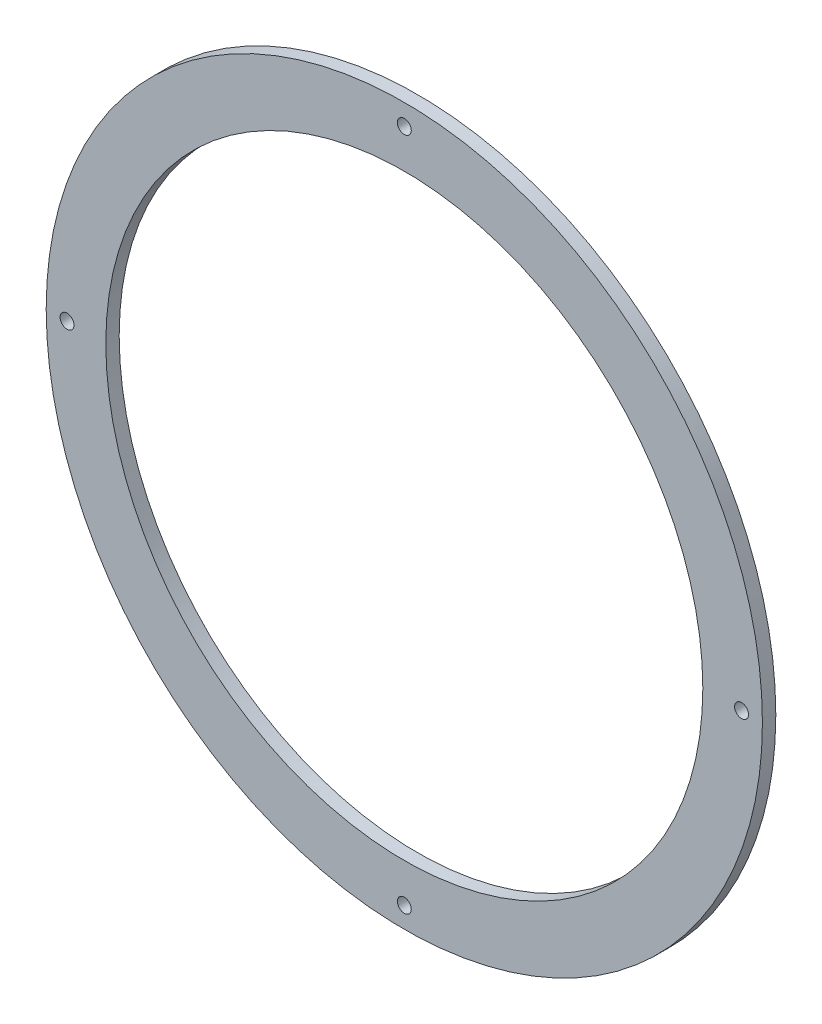
ISO-10303-21;
HEADER;
FILE_DESCRIPTION(('STEP AP214'),'2;1');
FILE_NAME('part.step','',(''),(''),'','','');
FILE_SCHEMA(('AUTOMOTIVE_DESIGN { 1 0 10303 214 1 1 1 1 }'));
ENDSEC;
DATA;
#1=APPLICATION_CONTEXT('core data for automotive mechanical design processes');
#2=APPLICATION_PROTOCOL_DEFINITION('international standard','automotive_design',2000,#1);
#3=PRODUCT_CONTEXT('',#1,'mechanical');
#4=PRODUCT('Part','Part','',(#3));
#5=PRODUCT_RELATED_PRODUCT_CATEGORY('part','',(#4));
#6=PRODUCT_DEFINITION_FORMATION('','',#4);
#7=PRODUCT_DEFINITION_CONTEXT('part definition',#1,'design');
#8=PRODUCT_DEFINITION('design','',#6,#7);
#9=PRODUCT_DEFINITION_SHAPE('','',#8);
#10=(LENGTH_UNIT() NAMED_UNIT(*) SI_UNIT(.MILLI.,.METRE.));
#11=(NAMED_UNIT(*) PLANE_ANGLE_UNIT() SI_UNIT($,.RADIAN.));
#12=(NAMED_UNIT(*) SI_UNIT($,.STERADIAN.) SOLID_ANGLE_UNIT());
#13=UNCERTAINTY_MEASURE_WITH_UNIT(LENGTH_MEASURE(1.E-05),#10,'distance_accuracy_value','');
#14=(GEOMETRIC_REPRESENTATION_CONTEXT(3) GLOBAL_UNCERTAINTY_ASSIGNED_CONTEXT((#13)) GLOBAL_UNIT_ASSIGNED_CONTEXT((#10,
#11,#12)) REPRESENTATION_CONTEXT('',''));
#15=CARTESIAN_POINT('',(0.,0.,0.));
#16=DIRECTION('',(0.,0.,1.));
#17=DIRECTION('',(1.,0.,0.));
#18=AXIS2_PLACEMENT_3D('',#15,#16,#17);
#19=CARTESIAN_POINT('',(0.,0.,3.175));
#20=DIRECTION('',(0.,0.,1.));
#21=DIRECTION('',(1.,0.,0.));
#22=AXIS2_PLACEMENT_3D('',#19,#20,#21);
#23=PLANE('',#22);
#24=CARTESIAN_POINT('',(0.,-79.97825,3.175));
#25=DIRECTION('',(0.,0.,1.));
#26=DIRECTION('',(1.,0.,0.));
#27=AXIS2_PLACEMENT_3D('',#24,#25,#26);
#28=CIRCLE('',#27,1.651);
#29=CARTESIAN_POINT('',(1.65100000000001,-79.97825,3.175));
#30=VERTEX_POINT('',#29);
#31=EDGE_CURVE('E67',#30,#30,#28,.T.);
#32=ORIENTED_EDGE('',*,*,#31,.F.);
#33=EDGE_LOOP('',(#32));
#34=FACE_BOUND('',#33,.T.);
#35=CARTESIAN_POINT('',(-79.97825,2.6944805660194E-13,3.175));
#36=DIRECTION('',(0.,0.,1.));
#37=DIRECTION('',(1.,0.,0.));
#38=AXIS2_PLACEMENT_3D('',#35,#36,#37);
#39=CIRCLE('',#38,1.651);
#40=CARTESIAN_POINT('',(-78.32725,2.6944805660194E-13,3.175));
#41=VERTEX_POINT('',#40);
#42=EDGE_CURVE('E61',#41,#41,#39,.T.);
#43=ORIENTED_EDGE('',*,*,#42,.F.);
#44=EDGE_LOOP('',(#43));
#45=FACE_BOUND('',#44,.T.);
#46=CARTESIAN_POINT('',(5.48690623990271E-13,79.97825,3.175));
#47=DIRECTION('',(0.,0.,1.));
#48=DIRECTION('',(1.,0.,0.));
#49=AXIS2_PLACEMENT_3D('',#46,#47,#48);
#50=CIRCLE('',#49,1.651);
#51=CARTESIAN_POINT('',(1.65100000000055,79.97825,3.175));
#52=VERTEX_POINT('',#51);
#53=EDGE_CURVE('E54',#52,#52,#50,.T.);
#54=ORIENTED_EDGE('',*,*,#53,.F.);
#55=EDGE_LOOP('',(#54));
#56=FACE_BOUND('',#55,.T.);
#57=CARTESIAN_POINT('',(79.97825,-8.41810979186416E-13,3.175));
#58=DIRECTION('',(0.,0.,1.));
#59=DIRECTION('',(1.,0.,0.));
#60=AXIS2_PLACEMENT_3D('',#57,#58,#59);
#61=CIRCLE('',#60,1.651);
#62=CARTESIAN_POINT('',(81.62925,-8.41810979186416E-13,3.175));
#63=VERTEX_POINT('',#62);
#64=EDGE_CURVE('E55',#63,#63,#61,.T.);
#65=ORIENTED_EDGE('',*,*,#64,.F.);
#66=EDGE_LOOP('',(#65));
#67=FACE_BOUND('',#66,.T.);
#68=CARTESIAN_POINT('',(0.,0.,3.175));
#69=DIRECTION('',(0.,0.,1.));
#70=DIRECTION('',(1.,0.,0.));
#71=AXIS2_PLACEMENT_3D('',#68,#69,#70);
#72=CIRCLE('',#71,84.93125);
#73=CARTESIAN_POINT('',(84.93125,0.,3.175));
#74=VERTEX_POINT('',#73);
#75=EDGE_CURVE('E10',#74,#74,#72,.T.);
#76=ORIENTED_EDGE('',*,*,#75,.T.);
#77=EDGE_LOOP('',(#76));
#78=FACE_BOUND('',#77,.T.);
#79=CARTESIAN_POINT('',(0.,0.,3.175));
#80=DIRECTION('',(0.,0.,1.));
#81=DIRECTION('',(1.,0.,0.));
#82=AXIS2_PLACEMENT_3D('',#79,#80,#81);
#83=CIRCLE('',#82,70.794845040123);
#84=CARTESIAN_POINT('',(70.794845040123,0.,3.175));
#85=VERTEX_POINT('',#84);
#86=EDGE_CURVE('E43',#85,#85,#83,.T.);
#87=ORIENTED_EDGE('',*,*,#86,.F.);
#88=EDGE_LOOP('',(#87));
#89=FACE_BOUND('',#88,.T.);
#90=ADVANCED_FACE('F32',(#34,#45,#56,#67,#78,#89),#23,.T.);
#91=CARTESIAN_POINT('',(0.,0.,0.));
#92=DIRECTION('',(0.,0.,1.));
#93=DIRECTION('',(1.,0.,0.));
#94=AXIS2_PLACEMENT_3D('',#91,#92,#93);
#95=PLANE('',#94);
#96=CARTESIAN_POINT('',(0.,-79.97825,0.));
#97=DIRECTION('',(0.,0.,1.));
#98=DIRECTION('',(1.,0.,0.));
#99=AXIS2_PLACEMENT_3D('',#96,#97,#98);
#100=CIRCLE('',#99,1.651);
#101=CARTESIAN_POINT('',(1.65100000000001,-79.97825,0.));
#102=VERTEX_POINT('',#101);
#103=EDGE_CURVE('E48',#102,#102,#100,.F.);
#104=ORIENTED_EDGE('',*,*,#103,.F.);
#105=EDGE_LOOP('',(#104));
#106=FACE_BOUND('',#105,.T.);
#107=CARTESIAN_POINT('',(-79.97825,2.6944805660194E-13,0.));
#108=DIRECTION('',(0.,0.,1.));
#109=DIRECTION('',(1.,0.,0.));
#110=AXIS2_PLACEMENT_3D('',#107,#108,#109);
#111=CIRCLE('',#110,1.651);
#112=CARTESIAN_POINT('',(-78.32725,2.6944805660194E-13,0.));
#113=VERTEX_POINT('',#112);
#114=EDGE_CURVE('E64',#113,#113,#111,.F.);
#115=ORIENTED_EDGE('',*,*,#114,.F.);
#116=EDGE_LOOP('',(#115));
#117=FACE_BOUND('',#116,.T.);
#118=CARTESIAN_POINT('',(5.48690623990271E-13,79.97825,0.));
#119=DIRECTION('',(0.,0.,1.));
#120=DIRECTION('',(1.,0.,0.));
#121=AXIS2_PLACEMENT_3D('',#118,#119,#120);
#122=CIRCLE('',#121,1.651);
#123=CARTESIAN_POINT('',(1.65100000000055,79.97825,0.));
#124=VERTEX_POINT('',#123);
#125=EDGE_CURVE('E58',#124,#124,#122,.F.);
#126=ORIENTED_EDGE('',*,*,#125,.F.);
#127=EDGE_LOOP('',(#126));
#128=FACE_BOUND('',#127,.T.);
#129=CARTESIAN_POINT('',(79.97825,-8.41810979186416E-13,0.));
#130=DIRECTION('',(0.,0.,1.));
#131=DIRECTION('',(1.,0.,0.));
#132=AXIS2_PLACEMENT_3D('',#129,#130,#131);
#133=CIRCLE('',#132,1.651);
#134=CARTESIAN_POINT('',(81.62925,-8.41810979186416E-13,0.));
#135=VERTEX_POINT('',#134);
#136=EDGE_CURVE('E51',#135,#135,#133,.F.);
#137=ORIENTED_EDGE('',*,*,#136,.F.);
#138=EDGE_LOOP('',(#137));
#139=FACE_BOUND('',#138,.T.);
#140=CARTESIAN_POINT('',(0.,0.,0.));
#141=DIRECTION('',(0.,0.,1.));
#142=DIRECTION('',(1.,0.,0.));
#143=AXIS2_PLACEMENT_3D('',#140,#141,#142);
#144=CIRCLE('',#143,84.93125);
#145=CARTESIAN_POINT('',(84.93125,0.,0.));
#146=VERTEX_POINT('',#145);
#147=EDGE_CURVE('E36',#146,#146,#144,.T.);
#148=ORIENTED_EDGE('',*,*,#147,.F.);
#149=EDGE_LOOP('',(#148));
#150=FACE_BOUND('',#149,.T.);
#151=CARTESIAN_POINT('',(0.,0.,0.));
#152=DIRECTION('',(0.,0.,1.));
#153=DIRECTION('',(1.,0.,0.));
#154=AXIS2_PLACEMENT_3D('',#151,#152,#153);
#155=CIRCLE('',#154,70.794845040123);
#156=CARTESIAN_POINT('',(70.794845040123,0.,0.));
#157=VERTEX_POINT('',#156);
#158=EDGE_CURVE('E45',#157,#157,#155,.T.);
#159=ORIENTED_EDGE('',*,*,#158,.T.);
#160=EDGE_LOOP('',(#159));
#161=FACE_BOUND('',#160,.T.);
#162=ADVANCED_FACE('F79',(#106,#117,#128,#139,#150,#161),#95,.F.);
#163=CARTESIAN_POINT('',(0.,0.,3.175));
#164=DIRECTION('',(0.,0.,-1.));
#165=DIRECTION('',(-1.,0.,0.));
#166=AXIS2_PLACEMENT_3D('',#163,#164,#165);
#167=CYLINDRICAL_SURFACE('',#166,84.93125);
#168=ORIENTED_EDGE('',*,*,#75,.F.);
#169=EDGE_LOOP('',(#168));
#170=FACE_BOUND('',#169,.T.);
#171=ORIENTED_EDGE('',*,*,#147,.T.);
#172=EDGE_LOOP('',(#171));
#173=FACE_BOUND('',#172,.T.);
#174=ADVANCED_FACE('F34',(#170,#173),#167,.T.);
#175=CARTESIAN_POINT('',(0.,0.,3.175));
#176=DIRECTION('',(0.,0.,-1.));
#177=DIRECTION('',(-1.,0.,0.));
#178=AXIS2_PLACEMENT_3D('',#175,#176,#177);
#179=CYLINDRICAL_SURFACE('',#178,70.794845040123);
#180=ORIENTED_EDGE('',*,*,#86,.T.);
#181=EDGE_LOOP('',(#180));
#182=FACE_BOUND('',#181,.T.);
#183=ORIENTED_EDGE('',*,*,#158,.F.);
#184=EDGE_LOOP('',(#183));
#185=FACE_BOUND('',#184,.T.);
#186=ADVANCED_FACE('F89',(#182,#185),#179,.F.);
#187=CARTESIAN_POINT('',(79.97825,-8.41810979186416E-13,-4.66973318295596));
#188=DIRECTION('',(0.,0.,1.));
#189=DIRECTION('',(1.,0.,0.));
#190=AXIS2_PLACEMENT_3D('',#187,#188,#189);
#191=CYLINDRICAL_SURFACE('',#190,1.651);
#192=ORIENTED_EDGE('',*,*,#136,.T.);
#193=EDGE_LOOP('',(#192));
#194=FACE_BOUND('',#193,.T.);
#195=ORIENTED_EDGE('',*,*,#64,.T.);
#196=EDGE_LOOP('',(#195));
#197=FACE_BOUND('',#196,.T.);
#198=ADVANCED_FACE('F92',(#194,#197),#191,.F.);
#199=CARTESIAN_POINT('',(5.48690623990271E-13,79.97825,-4.66973318295596));
#200=DIRECTION('',(0.,0.,1.));
#201=DIRECTION('',(1.,0.,0.));
#202=AXIS2_PLACEMENT_3D('',#199,#200,#201);
#203=CYLINDRICAL_SURFACE('',#202,1.651);
#204=ORIENTED_EDGE('',*,*,#125,.T.);
#205=EDGE_LOOP('',(#204));
#206=FACE_BOUND('',#205,.T.);
#207=ORIENTED_EDGE('',*,*,#53,.T.);
#208=EDGE_LOOP('',(#207));
#209=FACE_BOUND('',#208,.T.);
#210=ADVANCED_FACE('F107',(#206,#209),#203,.F.);
#211=CARTESIAN_POINT('',(-79.97825,2.6944805660194E-13,-4.66973318295596));
#212=DIRECTION('',(0.,0.,1.));
#213=DIRECTION('',(1.,0.,0.));
#214=AXIS2_PLACEMENT_3D('',#211,#212,#213);
#215=CYLINDRICAL_SURFACE('',#214,1.651);
#216=ORIENTED_EDGE('',*,*,#114,.T.);
#217=EDGE_LOOP('',(#216));
#218=FACE_BOUND('',#217,.T.);
#219=ORIENTED_EDGE('',*,*,#42,.T.);
#220=EDGE_LOOP('',(#219));
#221=FACE_BOUND('',#220,.T.);
#222=ADVANCED_FACE('F111',(#218,#221),#215,.F.);
#223=CARTESIAN_POINT('',(0.,-79.97825,-4.66973318295596));
#224=DIRECTION('',(0.,0.,1.));
#225=DIRECTION('',(1.,0.,0.));
#226=AXIS2_PLACEMENT_3D('',#223,#224,#225);
#227=CYLINDRICAL_SURFACE('',#226,1.651);
#228=ORIENTED_EDGE('',*,*,#103,.T.);
#229=EDGE_LOOP('',(#228));
#230=FACE_BOUND('',#229,.T.);
#231=ORIENTED_EDGE('',*,*,#31,.T.);
#232=EDGE_LOOP('',(#231));
#233=FACE_BOUND('',#232,.T.);
#234=ADVANCED_FACE('F75',(#230,#233),#227,.F.);
#235=CLOSED_SHELL('',(#90,#162,#174,#186,#198,#210,#222,#234));
#236=MANIFOLD_SOLID_BREP('B2',#235);
#237=ADVANCED_BREP_SHAPE_REPRESENTATION('',(#18,#236),#14);
#238=SHAPE_DEFINITION_REPRESENTATION(#9,#237);
ENDSEC;
END-ISO-10303-21;
